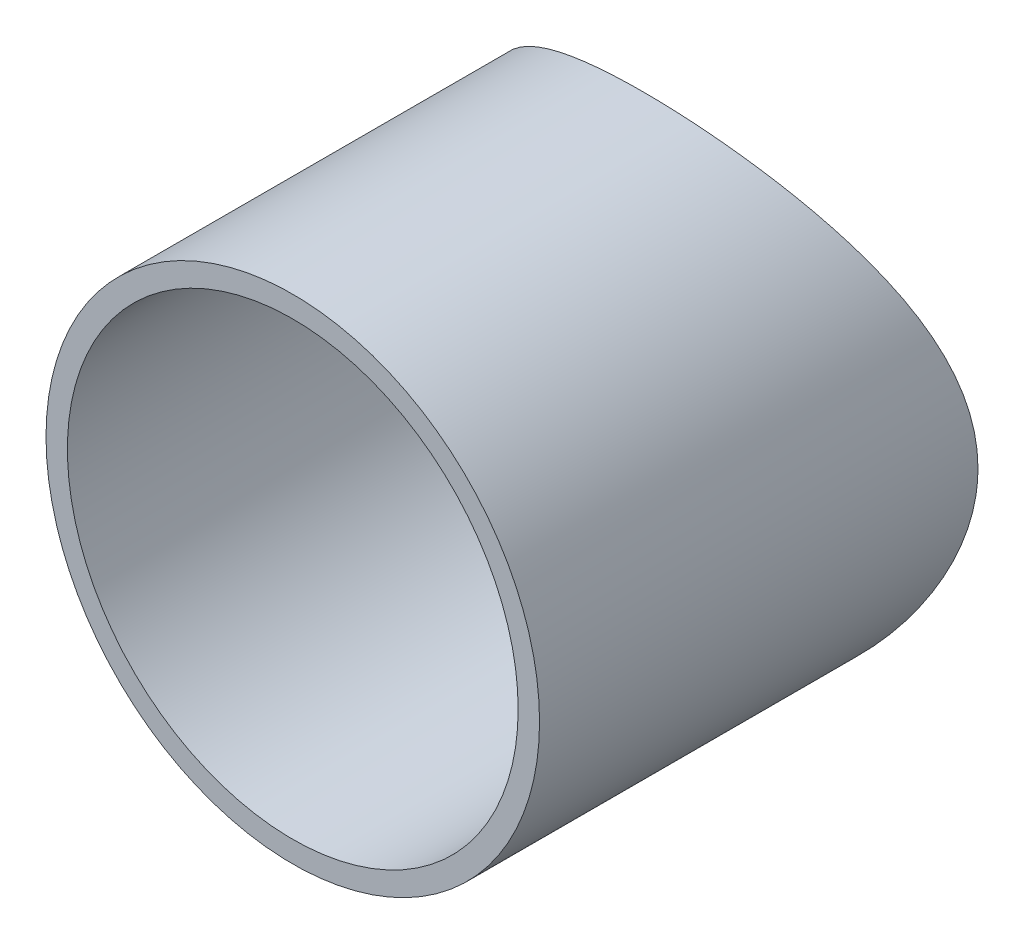
ISO-10303-21;
HEADER;
FILE_DESCRIPTION(('STEP AP214'),'2;1');
FILE_NAME('part.step','',(''),(''),'','','');
FILE_SCHEMA(('AUTOMOTIVE_DESIGN { 1 0 10303 214 1 1 1 1 }'));
ENDSEC;
DATA;
#1=APPLICATION_CONTEXT('core data for automotive mechanical design processes');
#2=APPLICATION_PROTOCOL_DEFINITION('international standard','automotive_design',2000,#1);
#3=PRODUCT_CONTEXT('',#1,'mechanical');
#4=PRODUCT('Part','Part','',(#3));
#5=PRODUCT_RELATED_PRODUCT_CATEGORY('part','',(#4));
#6=PRODUCT_DEFINITION_FORMATION('','',#4);
#7=PRODUCT_DEFINITION_CONTEXT('part definition',#1,'design');
#8=PRODUCT_DEFINITION('design','',#6,#7);
#9=PRODUCT_DEFINITION_SHAPE('','',#8);
#10=(LENGTH_UNIT() NAMED_UNIT(*) SI_UNIT(.MILLI.,.METRE.));
#11=(NAMED_UNIT(*) PLANE_ANGLE_UNIT() SI_UNIT($,.RADIAN.));
#12=(NAMED_UNIT(*) SI_UNIT($,.STERADIAN.) SOLID_ANGLE_UNIT());
#13=UNCERTAINTY_MEASURE_WITH_UNIT(LENGTH_MEASURE(1.E-05),#10,'distance_accuracy_value','');
#14=(GEOMETRIC_REPRESENTATION_CONTEXT(3) GLOBAL_UNCERTAINTY_ASSIGNED_CONTEXT((#13)) GLOBAL_UNIT_ASSIGNED_CONTEXT((#10,
#11,#12)) REPRESENTATION_CONTEXT('',''));
#15=CARTESIAN_POINT('',(0.,0.,0.));
#16=DIRECTION('',(0.,0.,1.));
#17=DIRECTION('',(1.,0.,0.));
#18=AXIS2_PLACEMENT_3D('',#15,#16,#17);
#19=CARTESIAN_POINT('',(0.,0.,0.));
#20=DIRECTION('',(0.,0.,1.));
#21=DIRECTION('',(1.,0.,0.));
#22=AXIS2_PLACEMENT_3D('',#19,#20,#21);
#23=CYLINDRICAL_SURFACE('',#22,17.399);
#24=CARTESIAN_POINT('',(0.,0.,57.15));
#25=DIRECTION('',(0.,0.,1.));
#26=DIRECTION('',(1.,0.,0.));
#27=AXIS2_PLACEMENT_3D('',#24,#25,#26);
#28=CIRCLE('',#27,17.399);
#29=CARTESIAN_POINT('',(17.399,0.,57.15));
#30=VERTEX_POINT('',#29);
#31=EDGE_CURVE('E29',#30,#30,#28,.T.);
#32=ORIENTED_EDGE('',*,*,#31,.T.);
#33=EDGE_LOOP('',(#32));
#34=FACE_BOUND('',#33,.T.);
#35=CARTESIAN_POINT('',(17.399,0.,24.5606310993834));
#36=CARTESIAN_POINT('',(17.3989993689897,-0.44154566988258,24.5606320245106));
#37=CARTESIAN_POINT('',(17.3821665887272,-0.883100088276201,24.5725822107765));
#38=CARTESIAN_POINT('',(17.3151265228958,-1.76239697819119,24.6198669539131));
#39=CARTESIAN_POINT('',(17.2649179727743,-2.20013930464205,24.655202396812));
#40=CARTESIAN_POINT('',(17.1318936661267,-3.06865119003044,24.7478193024934));
#41=CARTESIAN_POINT('',(17.0490489281047,-3.49941419626601,24.805120269818));
#42=CARTESIAN_POINT('',(16.8519726969886,-4.35052445171905,24.9394265347516));
#43=CARTESIAN_POINT('',(16.7377404577716,-4.77087145307514,25.0164323007671));
#44=CARTESIAN_POINT('',(16.4802305244956,-5.59576814365954,25.1868107171189));
#45=CARTESIAN_POINT('',(16.337161167862,-6.00040762990007,25.2800653550921));
#46=CARTESIAN_POINT('',(16.0228785393581,-6.7952414043634,25.4804215825364));
#47=CARTESIAN_POINT('',(15.8516524609958,-7.18542902005348,25.5875294681114));
#48=CARTESIAN_POINT('',(15.4825158159563,-7.94965282282205,25.8125590765119));
#49=CARTESIAN_POINT('',(15.2846073419307,-8.32369027349443,25.9304799510626));
#50=CARTESIAN_POINT('',(14.8633578009019,-9.05448574565661,26.1742165910765));
#51=CARTESIAN_POINT('',(14.640014038007,-9.41124192977885,26.3000331927738));
#52=CARTESIAN_POINT('',(14.1425122469251,-10.1455783372457,26.5711904649033));
#53=CARTESIAN_POINT('',(13.8654642573298,-10.5209804538354,26.7171343961876));
#54=CARTESIAN_POINT('',(13.282699697632,-11.2477585513782,27.0115953289454));
#55=CARTESIAN_POINT('',(12.9769815621963,-11.5991332186668,27.1601124705497));
#56=CARTESIAN_POINT('',(12.3379544596309,-12.2766875687615,27.4563064732133));
#57=CARTESIAN_POINT('',(12.004628209139,-12.6028512180837,27.6039827451004));
#58=CARTESIAN_POINT('',(11.3118107123049,-13.2282246407276,27.8950522016918));
#59=CARTESIAN_POINT('',(10.9523182712426,-13.5274331819103,28.038445190404));
#60=CARTESIAN_POINT('',(10.1720381027558,-14.1251340071522,28.3314250925354));
#61=CARTESIAN_POINT('',(9.74869605000634,-14.4206821926631,28.48024175117));
#62=CARTESIAN_POINT('',(8.87416088476563,-14.9747256729338,28.7647440867591));
#63=CARTESIAN_POINT('',(8.42296547873282,-15.2332179105407,28.9004286800053));
#64=CARTESIAN_POINT('',(7.49566183868969,-15.7102484210584,29.1546874472713));
#65=CARTESIAN_POINT('',(7.0195699231529,-15.928812453069,29.2732726422392));
#66=CARTESIAN_POINT('',(6.04555274367257,-16.3233715618932,29.4898260996017));
#67=CARTESIAN_POINT('',(5.54763076848298,-16.4993730250112,29.5877974547148));
#68=CARTESIAN_POINT('',(4.57969643591337,-16.7923723849768,29.7522276236304));
#69=CARTESIAN_POINT('',(4.11120588799033,-16.9132552153988,29.8207291121795));
#70=CARTESIAN_POINT('',(3.16320826836232,-17.1159043788283,29.9361290941537));
#71=CARTESIAN_POINT('',(2.68370180201095,-17.197672855909,29.983028771688));
#72=CARTESIAN_POINT('',(1.71818541701421,-17.3207887700142,30.0538148580428));
#73=CARTESIAN_POINT('',(1.23218038894496,-17.3621650408943,30.0777176829211));
#74=CARTESIAN_POINT('',(0.257842396359235,-17.403919525974,30.1018389465002));
#75=CARTESIAN_POINT('',(-0.230490351758082,-17.4043014796842,30.1020595454988));
#76=CARTESIAN_POINT('',(-1.14854723419672,-17.3664075792369,30.0801686694828));
#77=CARTESIAN_POINT('',(-1.57852599123375,-17.3325917426209,30.0606336847888));
#78=CARTESIAN_POINT('',(-2.43356940308792,-17.2333437221296,30.0035178080514));
#79=CARTESIAN_POINT('',(-2.85863452195142,-17.1679145492273,29.9659386346066));
#80=CARTESIAN_POINT('',(-3.70095665471035,-17.0062360271661,29.8736048767049));
#81=CARTESIAN_POINT('',(-4.1182134044584,-16.9099856373515,29.8188497123146));
#82=CARTESIAN_POINT('',(-4.94227465867427,-16.6877577401342,29.6933907098044));
#83=CARTESIAN_POINT('',(-5.34907874155276,-16.5617790357745,29.6226862295191));
#84=CARTESIAN_POINT('',(-6.15315457438387,-16.2802587340891,29.4662115774231));
#85=CARTESIAN_POINT('',(-6.55032198824365,-16.1244852029013,29.3803236382095));
#86=CARTESIAN_POINT('',(-7.32963470479107,-15.7855070597011,29.1956612549132));
#87=CARTESIAN_POINT('',(-7.71178011526604,-15.602302644559,29.0968869033163));
#88=CARTESIAN_POINT('',(-8.45942938485272,-15.2099155054498,28.8883800823178));
#89=CARTESIAN_POINT('',(-8.82493071778979,-15.0007288558393,28.778645957501));
#90=CARTESIAN_POINT('',(-9.53786510067682,-14.5578322345821,28.5502903115215));
#91=CARTESIAN_POINT('',(-9.88529635307284,-14.3241198301435,28.4316679090351));
#92=CARTESIAN_POINT('',(-10.5996306902769,-13.8054172371339,28.1737086581025));
#93=CARTESIAN_POINT('',(-10.9642031838292,-13.5176199662366,28.033555734316));
#94=CARTESIAN_POINT('',(-11.6680488985054,-12.9149729767017,27.7479857439045));
#95=CARTESIAN_POINT('',(-12.007320424819,-12.600121448843,27.6025683255997));
#96=CARTESIAN_POINT('',(-12.6596914267903,-11.9445181003403,27.3095226059682));
#97=CARTESIAN_POINT('',(-12.9727595482266,-11.6037361568694,27.1618918983619));
#98=CARTESIAN_POINT('',(-13.571041398645,-10.8979845616585,26.8679686909076));
#99=CARTESIAN_POINT('',(-13.8562539441232,-10.5330138833131,26.7216762481577));
#100=CARTESIAN_POINT('',(-14.4255317709769,-9.74119881232045,26.419087795986));
#101=CARTESIAN_POINT('',(-14.706423060149,-9.31186014336543,26.2633235326624));
#102=CARTESIAN_POINT('',(-15.2306966975122,-8.42707061962711,25.9628008175428));
#103=CARTESIAN_POINT('',(-15.4740736271544,-7.97161600568482,25.8180439571758));
#104=CARTESIAN_POINT('',(-15.9206342651954,-7.03748526634818,25.5450899075674));
#105=CARTESIAN_POINT('',(-16.123876990481,-6.55884454626421,25.4168685009287));
#106=CARTESIAN_POINT('',(-16.4879973180064,-5.58061418338775,25.1821913525879));
#107=CARTESIAN_POINT('',(-16.6488901662933,-5.08103215480234,25.0757277811125));
#108=CARTESIAN_POINT('',(-16.8934214874412,-4.18337198390024,24.9114113023485));
#109=CARTESIAN_POINT('',(-16.9863262908109,-3.78881096834085,24.8480122722588));
#110=CARTESIAN_POINT('',(-17.1446587260284,-2.99179857694458,24.7390330699683));
#111=CARTESIAN_POINT('',(-17.2100906232209,-2.58934843610779,24.6934501317813));
#112=CARTESIAN_POINT('',(-17.3125716401301,-1.77947227130678,24.6217097505794));
#113=CARTESIAN_POINT('',(-17.3496449740731,-1.3720507948787,24.5955357356582));
#114=CARTESIAN_POINT('',(-17.3949674387711,-0.554789177899292,24.5635032332073));
#115=CARTESIAN_POINT('',(-17.4032158586232,-0.144948977945188,24.5576452467275));
#116=CARTESIAN_POINT('',(-17.3907566390844,0.674365566263958,24.5664698274837));
#117=CARTESIAN_POINT('',(-17.370027846328,1.08383942467274,24.5811674002818));
#118=CARTESIAN_POINT('',(-17.2998862079448,1.89908924855965,24.6305818422613));
#119=CARTESIAN_POINT('',(-17.2504732444045,2.30486519882962,24.6652987937373));
#120=CARTESIAN_POINT('',(-17.1236180980034,3.11017390294765,24.7535341382002));
#121=CARTESIAN_POINT('',(-17.0461583753996,3.50970258644719,24.8070642958801));
#122=CARTESIAN_POINT('',(-16.8641923993503,4.29983737025423,24.9311233906744));
#123=CARTESIAN_POINT('',(-16.7596853242734,4.69044319911519,25.0016528441806));
#124=CARTESIAN_POINT('',(-16.5236717689639,5.46430736598403,25.1582648778111));
#125=CARTESIAN_POINT('',(-16.3919227503201,5.84746330710866,25.2444862763113));
#126=CARTESIAN_POINT('',(-16.1032020231417,6.60113781923339,25.429630094433));
#127=CARTESIAN_POINT('',(-15.9462200492062,6.97165117222248,25.5285576799456));
#128=CARTESIAN_POINT('',(-15.6082515179153,7.69859518292048,25.7365818216543));
#129=CARTESIAN_POINT('',(-15.4272640773389,8.05502532184632,25.845678751962));
#130=CARTESIAN_POINT('',(-15.0423743688257,8.75276861330218,26.0715663305933));
#131=CARTESIAN_POINT('',(-14.8384695522984,9.09408007862248,26.1883578340144));
#132=CARTESIAN_POINT('',(-14.3722527313367,9.81726667813268,26.4475105399239));
#133=CARTESIAN_POINT('',(-14.1059013679049,10.1961944563644,26.5908471944191));
#134=CARTESIAN_POINT('',(-13.5446078976844,10.9308058361423,26.881094432534));
#135=CARTESIAN_POINT('',(-13.2496632670308,11.2864873811471,27.0280053307854));
#136=CARTESIAN_POINT('',(-12.6322139799403,11.9735477494713,27.322041902146));
#137=CARTESIAN_POINT('',(-12.309687519343,12.3049069535625,27.4691676530928));
#138=CARTESIAN_POINT('',(-11.6385042889406,12.9415762295436,27.7602023697196));
#139=CARTESIAN_POINT('',(-11.2898464449073,13.2468852294379,27.90411120284));
#140=CARTESIAN_POINT('',(-10.5291296610485,13.8609646998562,28.2005515425507));
#141=CARTESIAN_POINT('',(-10.1142747858463,14.1666312363233,28.3523656460179));
#142=CARTESIAN_POINT('',(-9.25607745467933,14.7416765328353,28.6440259772824));
#143=CARTESIAN_POINT('',(-8.81273248072423,15.0110520789044,28.7838711446963));
#144=CARTESIAN_POINT('',(-7.90028970390231,15.510672866953,29.0475571065612));
#145=CARTESIAN_POINT('',(-7.43120707837245,15.7409408491806,29.1714071917182));
#146=CARTESIAN_POINT('',(-6.47018198086921,16.159720370498,29.3994950231109));
#147=CARTESIAN_POINT('',(-5.97824268818802,16.3482376960646,29.5037354868612));
#148=CARTESIAN_POINT('',(-5.01543004659779,16.6675424702318,29.6819047865195));
#149=CARTESIAN_POINT('',(-4.54601170351773,16.8017379015988,29.7575894864721));
#150=CARTESIAN_POINT('',(-3.5947012138083,17.0306370845578,29.8874270463948));
#151=CARTESIAN_POINT('',(-3.11280963594354,17.1253426334838,29.9415808863106));
#152=CARTESIAN_POINT('',(-2.1411048097385,17.2737443767657,30.0267072928651));
#153=CARTESIAN_POINT('',(-1.65129805217541,17.3274725888459,30.0576979577177));
#154=CARTESIAN_POINT('',(-0.66798167757504,17.3931516214162,30.0956074007952));
#155=CARTESIAN_POINT('',(-0.174472452411356,17.4051068024027,30.1025286915123));
#156=CARTESIAN_POINT('',(0.752042026388458,17.3881500361767,30.0927294888687));
#157=CARTESIAN_POINT('',(1.18517298315297,17.3639884318216,30.0787570112181));
#158=CARTESIAN_POINT('',(2.04740959439786,17.2835398189326,30.0323868299093));
#159=CARTESIAN_POINT('',(2.47651564014584,17.2272559666485,29.9999909364899));
#160=CARTESIAN_POINT('',(3.3276845028003,17.0832681436214,29.917539592973));
#161=CARTESIAN_POINT('',(3.74974722284664,16.9955637411537,29.8674839002263));
#162=CARTESIAN_POINT('',(4.58406040684575,16.7897652404101,29.7508593708941));
#163=CARTESIAN_POINT('',(4.99631052368729,16.6716700688307,29.6842899511001));
#164=CARTESIAN_POINT('',(5.80762598666601,16.406657589771,29.5362652692236));
#165=CARTESIAN_POINT('',(6.20671847844923,16.2598046096517,29.454843257739));
#166=CARTESIAN_POINT('',(6.99057681036873,15.9385214502447,29.2787127478303));
#167=CARTESIAN_POINT('',(7.3753428551564,15.7640916650749,29.1840044392912));
#168=CARTESIAN_POINT('',(8.1288535359706,15.3890895254164,28.9831606827964));
#169=CARTESIAN_POINT('',(8.49759613149823,15.1885138543244,28.8770237854229));
#170=CARTESIAN_POINT('',(9.21758562668811,14.7626654092933,28.6553283243517));
#171=CARTESIAN_POINT('',(9.56883076925693,14.5373901622656,28.5397688174961));
#172=CARTESIAN_POINT('',(10.2901909758671,14.0374615276391,28.2882175834687));
#173=CARTESIAN_POINT('',(10.6581364344191,13.7601023616665,28.1513761751028));
#174=CARTESIAN_POINT('',(11.3695593683433,13.1783723840577,27.8716532112618));
#175=CARTESIAN_POINT('',(11.7130353020452,12.8739998731893,27.7287712761134));
#176=CARTESIAN_POINT('',(12.3746397701784,12.2394370454529,27.4399074624935));
#177=CARTESIAN_POINT('',(12.6927397529546,11.909218452727,27.2939223198924));
#178=CARTESIAN_POINT('',(13.3019751743049,11.2246441701171,27.0022469727355));
#179=CARTESIAN_POINT('',(13.5931093601081,10.8702873601511,26.8565567821897));
#180=CARTESIAN_POINT('',(14.1776863294507,10.0984098203531,26.5530236998997));
#181=CARTESIAN_POINT('',(14.4678532611175,9.6782304755595,26.3956091429563));
#182=CARTESIAN_POINT('',(15.0115298247313,8.8114092418296,26.090247779653));
#183=CARTESIAN_POINT('',(15.2650343569207,8.36476368358805,25.9423022920377));
#184=CARTESIAN_POINT('',(15.7328773639491,7.44758191500543,25.6612699968839));
#185=CARTESIAN_POINT('',(15.9472605040461,6.9770737434811,25.5281663127414));
#186=CARTESIAN_POINT('',(16.3346922297662,6.01432078538696,25.2820170333201));
#187=CARTESIAN_POINT('',(16.5077533157735,5.5220826259084,25.1689653747469));
#188=CARTESIAN_POINT('',(16.779995957405,4.61879034979334,24.9880506368336));
#189=CARTESIAN_POINT('',(16.8870224985949,4.21099228925889,24.915672184431));
#190=CARTESIAN_POINT('',(17.0715895711513,3.3859459308312,24.7895777424392));
#191=CARTESIAN_POINT('',(17.1491344051297,2.96869902134441,24.7358590297139));
#192=CARTESIAN_POINT('',(17.2736059607559,2.12794202023554,24.6490997092664));
#193=CARTESIAN_POINT('',(17.3205630560799,1.70443857017104,24.6160385898541));
#194=CARTESIAN_POINT('',(17.3832609838321,0.853959562738938,24.5718034147935));
#195=CARTESIAN_POINT('',(17.3990006102002,0.426983871864134,24.5606302047661));
#196=CARTESIAN_POINT('',(17.399,0.,24.5606310993834));
#197=B_SPLINE_CURVE_WITH_KNOTS('',3,(#35,#36,#37,#38,#39,#40,#41,#42,#43,#44,#45,#46,#47,#48,
#49,#50,#51,#52,#53,#54,#55,#56,#57,#58,#59,#60,#61,#62,#63,#64,#65,#66,#67,#68,#69,#70,#71,#72,
#73,#74,#75,#76,#77,#78,#79,#80,#81,#82,#83,#84,#85,#86,#87,#88,#89,#90,#91,#92,#93,#94,#95,#96,
#97,#98,#99,#100,#101,#102,#103,#104,#105,#106,#107,#108,#109,#110,#111,#112,#113,#114,#115,
#116,#117,#118,#119,#120,#121,#122,#123,#124,#125,#126,#127,#128,#129,#130,#131,#132,#133,#134,
#135,#136,#137,#138,#139,#140,#141,#142,#143,#144,#145,#146,#147,#148,#149,#150,#151,#152,#153,
#154,#155,#156,#157,#158,#159,#160,#161,#162,#163,#164,#165,#166,#167,#168,#169,#170,#171,#172,
#173,#174,#175,#176,#177,#178,#179,#180,#181,#182,#183,#184,#185,#186,#187,#188,#189,#190,#191,
#192,#193,#194,#195,#196),.UNSPECIFIED.,.T.,.F.,(4,2,2,2,2,2,2,2,2,2,2,2,2,2,2,2,2,2,2,2,2,2,2,
2,2,2,2,2,2,2,2,2,2,2,2,2,2,2,2,2,2,2,2,2,2,2,2,2,2,2,2,2,2,2,2,2,2,2,2,2,2,2,2,2,2,2,2,2,2,2,2,
2,2,2,2,2,2,2,2,2,4),(0.,1.32417669409648,2.64840356190844,3.97380902634074,5.29924600016307,
6.61542992241513,7.93221414743791,9.24889515947591,10.5657158569194,12.0308032088624,
13.4959705982979,14.962062253758,16.4282208914413,18.0380706461644,19.6480531387668,
21.2569932781485,22.8656918539714,24.3295943417951,25.7934165758595,27.2561930990275,
28.7188361872877,30.0125388379959,31.3061182958842,32.5997414351329,33.8934166686793,
35.1976054545768,36.5017848808238,37.8061615951706,39.1106678175456,40.5646529530421,
42.0187353978506,43.4745335952502,44.9303936184761,46.5369347254331,48.1437076631011,
49.7480999711282,51.3519139020435,52.581481423569,53.8108579762128,55.0391836387341,
56.2675395949782,57.4967927194886,58.7260508971876,59.9560791537876,61.1861447799823,
62.4276737187942,63.6697090271515,64.9117900457623,66.1540093303676,67.6070644500074,
69.0602479446065,70.5145910303785,71.9689939351953,73.5785194623812,75.1881874376004,
76.7969161951679,78.4054218495279,79.8854741884583,81.3654591572512,82.8442865487571,
84.3229595675953,85.6234740481326,86.9238607654389,88.2242653510113,89.5247158689632,
90.8222900135801,92.119845615407,93.4175659725109,94.7154163850163,96.1559243060595,
97.5965229043037,99.0387201722351,100.480984407876,102.082062867893,103.683363824937,
105.282824964585,106.881801634557,108.163720514244,109.445452236565,110.725909249019,
112.006415729873),.UNSPECIFIED.);
#198=CARTESIAN_POINT('',(17.399,0.,24.5606310993834));
#199=VERTEX_POINT('',#198);
#200=EDGE_CURVE('E18',#199,#199,#197,.T.);
#201=ORIENTED_EDGE('',*,*,#200,.T.);
#202=EDGE_LOOP('',(#201));
#203=FACE_BOUND('',#202,.T.);
#204=ADVANCED_FACE('F14',(#34,#203),#23,.F.);
#205=CARTESIAN_POINT('',(0.,0.,0.));
#206=DIRECTION('',(0.,1.,0.));
#207=DIRECTION('',(0.,0.,1.));
#208=AXIS2_PLACEMENT_3D('',#205,#206,#207);
#209=CYLINDRICAL_SURFACE('',#208,30.099);
#210=ORIENTED_EDGE('',*,*,#200,.F.);
#211=EDGE_LOOP('',(#210));
#212=FACE_BOUND('',#211,.T.);
#213=CARTESIAN_POINT('',(19.05,0.,23.3033753134605));
#214=CARTESIAN_POINT('',(19.0499964286924,0.472043545890176,23.3033811096579));
#215=CARTESIAN_POINT('',(19.0324211372841,0.94414392231142,23.3177796485911));
#216=CARTESIAN_POINT('',(18.9624498991082,1.88424344304824,23.3747141684592));
#217=CARTESIAN_POINT('',(18.9100351542867,2.3522402350307,23.4172653394344));
#218=CARTESIAN_POINT('',(18.7712148429126,3.28100037719172,23.5286887195718));
#219=CARTESIAN_POINT('',(18.6847351836268,3.74174566790589,23.5976182935843));
#220=CARTESIAN_POINT('',(18.4792431160487,4.65162772621434,23.7588798978588));
#221=CARTESIAN_POINT('',(18.3602335385331,5.10076550018233,23.8512098917487));
#222=CARTESIAN_POINT('',(18.0925388847279,5.98099424613939,24.0548919093312));
#223=CARTESIAN_POINT('',(17.9441296839205,6.41221099465055,24.16606580454));
#224=CARTESIAN_POINT('',(17.6185656699363,7.25909834949212,24.4044386521596));
#225=CARTESIAN_POINT('',(17.4414066282712,7.67476665789581,24.5316399612449));
#226=CARTESIAN_POINT('',(17.0598732510647,8.48913406834667,24.7984815741484));
#227=CARTESIAN_POINT('',(16.8555036749214,8.88783612190683,24.9381197012303));
#228=CARTESIAN_POINT('',(16.4208141852716,9.66739682383541,25.2264681438916));
#229=CARTESIAN_POINT('',(16.1904927071825,10.0482543944377,25.3751790061978));
#230=CARTESIAN_POINT('',(15.6714656758414,10.8426374919245,25.6994366551252));
#231=CARTESIAN_POINT('',(15.3790897113264,11.2534132828229,25.8758537957221));
#232=CARTESIAN_POINT('',(14.7635061022874,12.0496748734941,26.2319490904412));
#233=CARTESIAN_POINT('',(14.4402964745316,12.435159043806,26.4116274537237));
#234=CARTESIAN_POINT('',(13.7639347985054,13.1799017296586,26.7703294712885));
#235=CARTESIAN_POINT('',(13.4107581635878,13.5391382515408,26.9493524597719));
#236=CARTESIAN_POINT('',(12.6757931980663,14.2295822457694,27.3027538777893));
#237=CARTESIAN_POINT('',(12.2940031784151,14.5607880610029,27.4771320323141));
#238=CARTESIAN_POINT('',(11.4534348202648,15.2330568536948,27.8388808198039));
#239=CARTESIAN_POINT('',(10.9910012644315,15.570165637626,28.0251461342588));
#240=CARTESIAN_POINT('',(10.0333435426301,16.2038319929742,28.3820885917296));
#241=CARTESIAN_POINT('',(9.5381159482412,16.5003853145947,28.5527641004722));
#242=CARTESIAN_POINT('',(8.51791666418116,17.0494237247364,28.8735268344577));
#243=CARTESIAN_POINT('',(7.99296808441381,17.3019424460616,29.0236297537365));
#244=CARTESIAN_POINT('',(6.91654377805486,17.7596669877427,29.2987986944928));
#245=CARTESIAN_POINT('',(6.3650730535735,17.9648816877317,29.4238694142862));
#246=CARTESIAN_POINT('',(5.29847985759111,18.305978039931,29.6334268689036));
#247=CARTESIAN_POINT('',(4.7855109428843,18.4468401457226,29.7207757862651));
#248=CARTESIAN_POINT('',(3.74597713522144,18.6856754058247,29.869600241993));
#249=CARTESIAN_POINT('',(3.21941309676932,18.7836512487796,29.9310774023136));
#250=CARTESIAN_POINT('',(2.15790631094233,18.9349706269843,30.0262711064919));
#251=CARTESIAN_POINT('',(1.62297160754452,18.9883546170029,30.0600128121571));
#252=CARTESIAN_POINT('',(0.549489109423356,19.0496581394133,30.0987738982047));
#253=CARTESIAN_POINT('',(0.0109417547668537,19.0575831121058,30.1037967155155));
#254=CARTESIAN_POINT('',(-0.99024478379889,19.0299005137296,30.0862821371761));
#255=CARTESIAN_POINT('',(-1.4531248112464,19.000137197032,30.0674446012371));
#256=CARTESIAN_POINT('',(-2.37412115481649,18.9071469094216,30.0087685977492));
#257=CARTESIAN_POINT('',(-2.83223801458744,18.8439238011882,29.968932554321));
#258=CARTESIAN_POINT('',(-3.74054000559729,18.6848463508602,29.8691639490416));
#259=CARTESIAN_POINT('',(-4.19072481141624,18.588990673247,29.8092305646893));
#260=CARTESIAN_POINT('',(-5.08026831205508,18.3658288569096,29.6705802160046));
#261=CARTESIAN_POINT('',(-5.51962654739728,18.2385213858963,29.5918624559762));
#262=CARTESIAN_POINT('',(-6.38555098588613,17.9536980587,29.4171703467752));
#263=CARTESIAN_POINT('',(-6.81209943380972,17.7961423262216,29.3211732287649));
#264=CARTESIAN_POINT('',(-7.64966554255799,17.4525080559975,29.113889514145));
#265=CARTESIAN_POINT('',(-8.06068340803638,17.2664298942687,29.0026031190989));
#266=CARTESIAN_POINT('',(-8.86549194668315,16.867344990583,28.766798746861));
#267=CARTESIAN_POINT('',(-9.25928144231839,16.6543364118311,28.642279867237));
#268=CARTESIAN_POINT('',(-10.028246699608,16.2029498148767,28.3821926176968));
#269=CARTESIAN_POINT('',(-10.40342038548,15.9645689767836,28.2466230199888));
#270=CARTESIAN_POINT('',(-11.1800151037953,15.4323802341892,27.9490790761088));
#271=CARTESIAN_POINT('',(-11.5787952042619,15.1353725015932,27.7859291089016));
#272=CARTESIAN_POINT('',(-12.3500239248784,14.5129261864017,27.4518371302507));
#273=CARTESIAN_POINT('',(-12.7224706534113,14.18748556512,27.2808945604852));
#274=CARTESIAN_POINT('',(-13.4404258796066,13.5093165150629,26.934435829275));
#275=CARTESIAN_POINT('',(-13.7858963307524,13.1565508955938,26.758913657995));
#276=CARTESIAN_POINT('',(-14.448288071092,12.4254902889073,26.4071472753367));
#277=CARTESIAN_POINT('',(-14.7652079459559,12.047194038583,26.2309030286401));
#278=CARTESIAN_POINT('',(-15.4103339062582,11.2133121177501,25.8578490947492));
#279=CARTESIAN_POINT('',(-15.7342552937249,10.7541977396843,25.6614869478261));
#280=CARTESIAN_POINT('',(-16.342014764231,9.80602840637107,25.2787928239379));
#281=CARTESIAN_POINT('',(-16.6258450205764,9.31696763155104,25.0924628098533));
#282=CARTESIAN_POINT('',(-17.1506240797184,8.31142242064715,24.7367388622229));
#283=CARTESIAN_POINT('',(-17.3916358121512,7.79497970242316,24.5673202375927));
#284=CARTESIAN_POINT('',(-17.8283743125202,6.73639625030758,24.2522464416436));
#285=CARTESIAN_POINT('',(-18.0241208387135,6.19426685363238,24.1065809103199));
#286=CARTESIAN_POINT('',(-18.3212470844934,5.2358777391786,23.881092121581));
#287=CARTESIAN_POINT('',(-18.4338616133664,4.82476315326887,23.7940809956612));
#288=CARTESIAN_POINT('',(-18.6318453565921,3.99245675146918,23.639373135442));
#289=CARTESIAN_POINT('',(-18.7172190042562,3.57126658733326,23.5716732585278));
#290=CARTESIAN_POINT('',(-18.859480100837,2.72172035657459,23.4580076706048));
#291=CARTESIAN_POINT('',(-18.9164024520992,2.29337373934011,23.4120153339661));
#292=CARTESIAN_POINT('',(-19.0010372336403,1.43191385733841,23.3433797745503));
#293=CARTESIAN_POINT('',(-19.0287492595379,0.998800526665728,23.3207368750179));
#294=CARTESIAN_POINT('',(-19.054526988174,0.1299472405899,23.2996800503784));
#295=CARTESIAN_POINT('',(-19.0525140406314,-0.305796632634683,23.3013304035481));
#296=CARTESIAN_POINT('',(-19.0186853972974,-1.17534257677347,23.3289492165018));
#297=CARTESIAN_POINT('',(-18.986869535715,-1.60914463687205,23.3549178115662));
#298=CARTESIAN_POINT('',(-18.8939372678199,-2.47184495480492,23.4301618600023));
#299=CARTESIAN_POINT('',(-18.8327997515817,-2.90073945134375,23.4794541047335));
#300=CARTESIAN_POINT('',(-18.6821555325241,-3.75043563532767,23.5994937813449));
#301=CARTESIAN_POINT('',(-18.5926481631025,-4.17123713236628,23.6702417173647));
#302=CARTESIAN_POINT('',(-18.388770079443,-4.99308469654905,23.8289574237033));
#303=CARTESIAN_POINT('',(-18.2749996169301,-5.39436209264624,23.9165050999748));
#304=CARTESIAN_POINT('',(-18.022655349524,-6.18537210038795,24.1072332794926));
#305=CARTESIAN_POINT('',(-17.8840717692126,-6.57510009122564,24.2104199414317));
#306=CARTESIAN_POINT('',(-17.583332854521,-7.3415521375009,24.4297117736263));
#307=CARTESIAN_POINT('',(-17.4211785086641,-7.71827673746203,24.5458164020734));
#308=CARTESIAN_POINT('',(-17.0743815818836,-8.4578270594428,24.788305035742));
#309=CARTESIAN_POINT('',(-16.889736017595,-8.82065092918038,24.9146904039199));
#310=CARTESIAN_POINT('',(-16.4612088452912,-9.60027760635759,25.2003345228271));
#311=CARTESIAN_POINT('',(-16.2127726627587,-10.0139826695114,25.361229950127));
#312=CARTESIAN_POINT('',(-15.6867000801509,-10.8194913262641,25.6899487113834));
#313=CARTESIAN_POINT('',(-15.4090609892964,-11.2112928965547,25.8577726828746));
#314=CARTESIAN_POINT('',(-14.825488634821,-11.9723653392767,26.1967296498121));
#315=CARTESIAN_POINT('',(-14.5195289306607,-12.3416146118025,26.3678656170798));
#316=CARTESIAN_POINT('',(-13.880557218281,-13.0561236090684,26.7097597135681));
#317=CARTESIAN_POINT('',(-13.5475434255937,-13.4013817485796,26.8805178171007));
#318=CARTESIAN_POINT('',(-12.7962561398224,-14.1235331378447,27.2471805743538));
#319=CARTESIAN_POINT('',(-12.3731357009786,-14.4957559997034,27.442398189211));
#320=CARTESIAN_POINT('',(-11.4926798845175,-15.2032818035645,27.8226183261844));
#321=CARTESIAN_POINT('',(-11.035340329937,-15.5385802259897,28.0076195964343));
#322=CARTESIAN_POINT('',(-10.0885120841335,-16.1693503155527,28.3624262011295));
#323=CARTESIAN_POINT('',(-9.5990305698375,-16.4648308288966,28.5322349080269));
#324=CARTESIAN_POINT('',(-8.59039635818775,-17.0128445392792,28.8519436785586));
#325=CARTESIAN_POINT('',(-8.0712472617785,-17.2653829337478,29.00184615103));
#326=CARTESIAN_POINT('',(-7.03554973090194,-17.7116906630303,29.2698003004733));
#327=CARTESIAN_POINT('',(-6.5203911873763,-17.9079067845124,29.3891396057806));
#328=CARTESIAN_POINT('',(-5.47020297849927,-18.2561036616901,29.6025958794029));
#329=CARTESIAN_POINT('',(-4.93517367291942,-18.4080852178381,29.6967133041214));
#330=CARTESIAN_POINT('',(-3.85049447586941,-18.6651131291414,29.8567185002272));
#331=CARTESIAN_POINT('',(-3.30086327582682,-18.7702166885168,29.9226406736211));
#332=CARTESIAN_POINT('',(-2.19176692945455,-18.9317860896414,30.024254304336));
#333=CARTESIAN_POINT('',(-1.63230354893123,-18.9882605756377,30.0599511344597));
#334=CARTESIAN_POINT('',(-0.594916187995171,-19.0466805358437,30.0968931274945));
#335=CARTESIAN_POINT('',(-0.117525944318274,-19.0556104280278,30.1025507062547));
#336=CARTESIAN_POINT('',(0.836270296196086,-19.037609527429,30.0911583552341));
#337=CARTESIAN_POINT('',(1.31267640606509,-19.010683111951,30.0741111972264));
#338=CARTESIAN_POINT('',(2.26077018898117,-18.9213677085176,30.0177325377784));
#339=CARTESIAN_POINT('',(2.73245815208587,-18.8589809143661,29.978402414904));
#340=CARTESIAN_POINT('',(3.66764925065179,-18.6996216319724,29.8784086364232));
#341=CARTESIAN_POINT('',(4.13115224614397,-18.6026485528791,29.8177446163617));
#342=CARTESIAN_POINT('',(5.02781632609349,-18.380099750888,29.6794222164113));
#343=CARTESIAN_POINT('',(5.46143920811129,-18.2558740751336,29.6025711922271));
#344=CARTESIAN_POINT('',(6.31579265977216,-17.9781818602665,29.4321305816411));
#345=CARTESIAN_POINT('',(6.73652379156096,-17.8247165982604,29.3385417263139));
#346=CARTESIAN_POINT('',(7.56308082731033,-17.490029723634,29.1364145522204));
#347=CARTESIAN_POINT('',(7.96890604234099,-17.3088068300923,29.0278755435782));
#348=CARTESIAN_POINT('',(8.76397048251599,-16.9201406151368,28.7978111986365));
#349=CARTESIAN_POINT('',(9.15320865202344,-16.7126956282123,28.6762850375266));
#350=CARTESIAN_POINT('',(9.95235497632019,-16.2507602956343,28.4094250380874));
#351=CARTESIAN_POINT('',(10.3603498410292,-15.9936318893526,28.262926732155));
#352=CARTESIAN_POINT('',(11.1531154279581,-15.4512534201159,27.9595778022842));
#353=CARTESIAN_POINT('',(11.5378848438405,-15.1660017777146,27.802726597074));
#354=CARTESIAN_POINT('',(12.2833992715147,-14.5687661433284,27.4814992476887));
#355=CARTESIAN_POINT('',(12.6441207184945,-14.256756595994,27.3171159813177));
#356=CARTESIAN_POINT('',(13.3401594402803,-13.6076864208085,26.9840478058006));
#357=CARTESIAN_POINT('',(13.675474656682,-13.2706237675364,26.8153625495855));
#358=CARTESIAN_POINT('',(14.367759611611,-12.5206929283057,26.4516923474389));
#359=CARTESIAN_POINT('',(14.7205179441443,-12.1040108317307,26.2565317686574));
#360=CARTESIAN_POINT('',(15.3898113254652,-11.2407545620662,25.8699228902264));
#361=CARTESIAN_POINT('',(15.7063397897492,-10.7941749786354,25.6784752706135));
#362=CARTESIAN_POINT('',(16.3012954840708,-9.87273780952856,25.304958197376));
#363=CARTESIAN_POINT('',(16.579731990894,-9.39788714946846,25.1228864671389));
#364=CARTESIAN_POINT('',(17.0963882153084,-8.421454251342,24.7741889166056));
#365=CARTESIAN_POINT('',(17.3346207389446,-7.91988059249709,24.6075581855922));
#366=CARTESIAN_POINT('',(17.7212352969221,-7.00364469906985,24.3300500138661));
#367=CARTESIAN_POINT('',(17.8778958789556,-6.59374975033729,24.2149216560523));
#368=CARTESIAN_POINT('',(18.1636250341629,-5.76014721659129,24.0013408937634));
#369=CARTESIAN_POINT('',(18.2926936506077,-5.33643965324061,23.9028884631366));
#370=CARTESIAN_POINT('',(18.5214491309873,-4.4782887046238,23.7260743137994));
#371=CARTESIAN_POINT('',(18.6212138302502,-4.04387714332673,23.6476594459772));
#372=CARTESIAN_POINT('',(18.7904044752206,-3.16589510633249,23.5134476216519));
#373=CARTESIAN_POINT('',(18.8598448802788,-2.72232910159124,23.4576398864466));
#374=CARTESIAN_POINT('',(18.9588603619197,-1.89941745168542,23.3776552466743));
#375=CARTESIAN_POINT('',(18.9929925193618,-1.52096386803751,23.3498802048867));
#376=CARTESIAN_POINT('',(19.0385668542472,-0.761686264497996,23.3127354055649));
#377=CARTESIAN_POINT('',(19.0500028814588,-0.380861630132269,23.3033706368809));
#378=CARTESIAN_POINT('',(19.05,0.,23.3033753134605));
#379=B_SPLINE_CURVE_WITH_KNOTS('',3,(#213,#214,#215,#216,#217,#218,#219,#220,#221,#222,#223,
#224,#225,#226,#227,#228,#229,#230,#231,#232,#233,#234,#235,#236,#237,#238,#239,#240,#241,#242,
#243,#244,#245,#246,#247,#248,#249,#250,#251,#252,#253,#254,#255,#256,#257,#258,#259,#260,#261,
#262,#263,#264,#265,#266,#267,#268,#269,#270,#271,#272,#273,#274,#275,#276,#277,#278,#279,#280,
#281,#282,#283,#284,#285,#286,#287,#288,#289,#290,#291,#292,#293,#294,#295,#296,#297,#298,#299,
#300,#301,#302,#303,#304,#305,#306,#307,#308,#309,#310,#311,#312,#313,#314,#315,#316,#317,#318,
#319,#320,#321,#322,#323,#324,#325,#326,#327,#328,#329,#330,#331,#332,#333,#334,#335,#336,#337,
#338,#339,#340,#341,#342,#343,#344,#345,#346,#347,#348,#349,#350,#351,#352,#353,#354,#355,#356,
#357,#358,#359,#360,#361,#362,#363,#364,#365,#366,#367,#368,#369,#370,#371,#372,#373,#374,#375,
#376,#377,#378),.UNSPECIFIED.,.T.,.F.,(4,2,2,2,2,2,2,2,2,2,2,2,2,2,2,2,2,2,2,2,2,2,2,2,2,2,2,2,
2,2,2,2,2,2,2,2,2,2,2,2,2,2,2,2,2,2,2,2,2,2,2,2,2,2,2,2,2,2,2,2,2,2,2,2,2,2,2,2,2,2,2,2,2,2,2,2,
2,2,2,2,2,2,4),(0.,1.4156921526922,2.83214878016571,4.25170342920978,5.67113458689962,
7.07782851023646,8.48472951606648,9.89138476314508,11.2981248597705,12.8990894694518,
14.5001571232527,16.1025513273082,17.705040195265,19.5080871012545,21.3113228035342,
23.1131751375744,24.9146889625365,26.5295584971442,28.1443267771328,29.7576285056725,
31.3707371585538,32.7617172076984,34.1525367137531,35.5434131472449,36.9343485079703,
38.3271302894018,39.7198937110948,41.1127521778283,42.5057656097933,44.0741321929524,
45.6426113230768,47.2132640658329,48.783994572379,50.5674590501575,52.3512712206839,
54.1324396667877,55.9128291592872,57.2167203007411,58.520399132339,59.8224747394466,
61.1245683719662,62.4301078725946,63.7356546358706,65.0421427328215,66.3486615304089,
67.625986647871,68.9038160942102,70.1815919657184,71.4595375137419,72.9841392160606,
74.5088815196683,76.0350619860664,77.5613432000765,79.3483410670241,81.1355574212115,
82.9223760588365,84.7089782775825,86.3985546762301,88.0881004990283,89.7755789262698,
91.4627573273647,92.8934487220843,94.3239654753304,95.7543937373699,97.1848464371525,
98.5560905119797,99.9272747082688,101.298522199165,102.6698568294,104.180411644429,
105.691051343034,107.203150209049,108.715371454098,110.452789904363,112.190523617553,
113.927833372753,115.664588699501,117.024355753936,118.384120675909,119.740240515354,
121.095713016404,122.237634723975,123.379865828995),.UNSPECIFIED.);
#380=CARTESIAN_POINT('',(19.05,0.,23.3033753134605));
#381=VERTEX_POINT('',#380);
#382=EDGE_CURVE('E24',#381,#381,#379,.T.);
#383=ORIENTED_EDGE('',*,*,#382,.F.);
#384=EDGE_LOOP('',(#383));
#385=FACE_BOUND('',#384,.T.);
#386=ADVANCED_FACE('F34',(#212,#385),#209,.F.);
#387=CARTESIAN_POINT('',(0.,0.,57.15));
#388=DIRECTION('',(0.,0.,-1.));
#389=DIRECTION('',(-1.,0.,0.));
#390=AXIS2_PLACEMENT_3D('',#387,#388,#389);
#391=PLANE('',#390);
#392=ORIENTED_EDGE('',*,*,#31,.F.);
#393=EDGE_LOOP('',(#392));
#394=FACE_BOUND('',#393,.T.);
#395=CARTESIAN_POINT('',(0.,0.,57.15));
#396=DIRECTION('',(0.,0.,1.));
#397=DIRECTION('',(1.,0.,0.));
#398=AXIS2_PLACEMENT_3D('',#395,#396,#397);
#399=CIRCLE('',#398,19.05);
#400=CARTESIAN_POINT('',(19.05,0.,57.15));
#401=VERTEX_POINT('',#400);
#402=EDGE_CURVE('E10',#401,#401,#399,.F.);
#403=ORIENTED_EDGE('',*,*,#402,.F.);
#404=EDGE_LOOP('',(#403));
#405=FACE_BOUND('',#404,.T.);
#406=ADVANCED_FACE('F40',(#394,#405),#391,.F.);
#407=CARTESIAN_POINT('',(0.,0.,0.));
#408=DIRECTION('',(0.,0.,1.));
#409=DIRECTION('',(1.,0.,0.));
#410=AXIS2_PLACEMENT_3D('',#407,#408,#409);
#411=CYLINDRICAL_SURFACE('',#410,19.05);
#412=ORIENTED_EDGE('',*,*,#402,.T.);
#413=EDGE_LOOP('',(#412));
#414=FACE_BOUND('',#413,.T.);
#415=ORIENTED_EDGE('',*,*,#382,.T.);
#416=EDGE_LOOP('',(#415));
#417=FACE_BOUND('',#416,.T.);
#418=ADVANCED_FACE('F37',(#414,#417),#411,.T.);
#419=CLOSED_SHELL('',(#204,#386,#406,#418));
#420=MANIFOLD_SOLID_BREP('B1',#419);
#421=ADVANCED_BREP_SHAPE_REPRESENTATION('',(#18,#420),#14);
#422=SHAPE_DEFINITION_REPRESENTATION(#9,#421);
ENDSEC;
END-ISO-10303-21;
